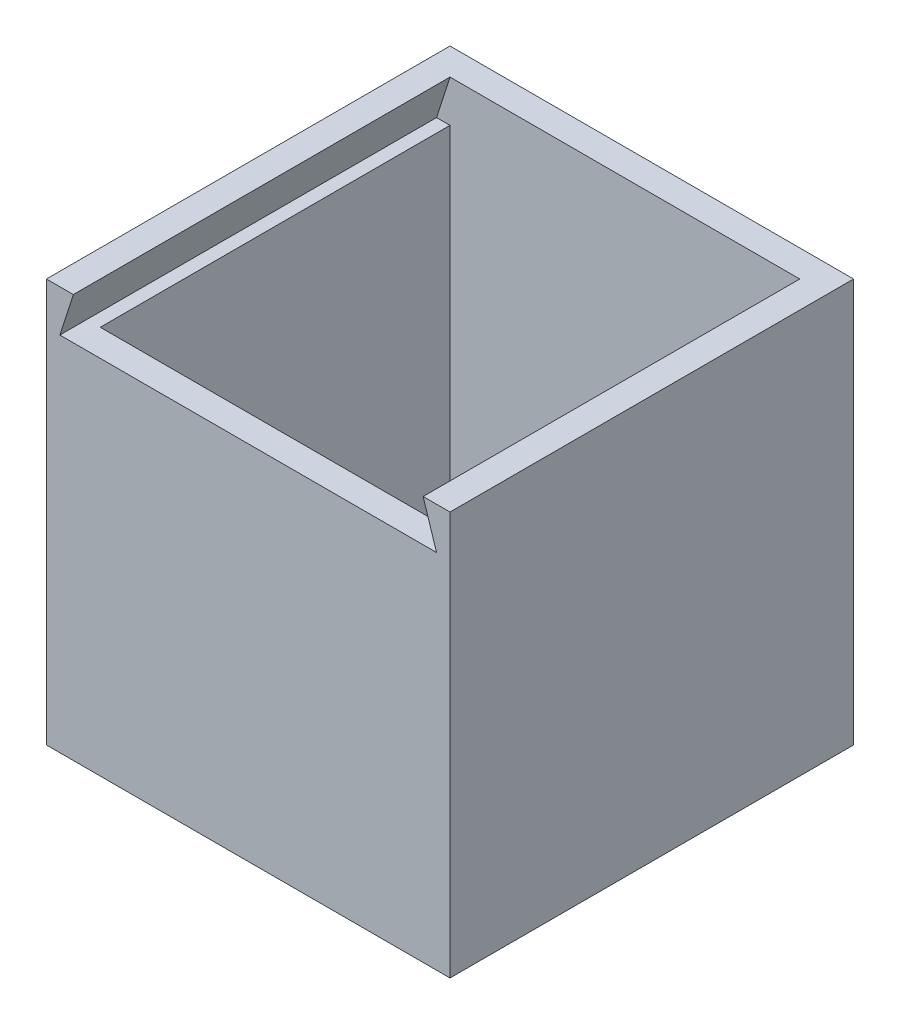
ISO-10303-21;
HEADER;
FILE_DESCRIPTION(('STEP AP214'),'2;1');
FILE_NAME('part.step','',(''),(''),'','','');
FILE_SCHEMA(('AUTOMOTIVE_DESIGN { 1 0 10303 214 1 1 1 1 }'));
ENDSEC;
DATA;
#1=APPLICATION_CONTEXT('core data for automotive mechanical design processes');
#2=APPLICATION_PROTOCOL_DEFINITION('international standard','automotive_design',2000,#1);
#3=PRODUCT_CONTEXT('',#1,'mechanical');
#4=PRODUCT('Part','Part','',(#3));
#5=PRODUCT_RELATED_PRODUCT_CATEGORY('part','',(#4));
#6=PRODUCT_DEFINITION_FORMATION('','',#4);
#7=PRODUCT_DEFINITION_CONTEXT('part definition',#1,'design');
#8=PRODUCT_DEFINITION('design','',#6,#7);
#9=PRODUCT_DEFINITION_SHAPE('','',#8);
#10=(LENGTH_UNIT() NAMED_UNIT(*) SI_UNIT(.MILLI.,.METRE.));
#11=(NAMED_UNIT(*) PLANE_ANGLE_UNIT() SI_UNIT($,.RADIAN.));
#12=(NAMED_UNIT(*) SI_UNIT($,.STERADIAN.) SOLID_ANGLE_UNIT());
#13=UNCERTAINTY_MEASURE_WITH_UNIT(LENGTH_MEASURE(1.E-05),#10,'distance_accuracy_value','');
#14=(GEOMETRIC_REPRESENTATION_CONTEXT(3) GLOBAL_UNCERTAINTY_ASSIGNED_CONTEXT((#13)) GLOBAL_UNIT_ASSIGNED_CONTEXT((#10,
#11,#12)) REPRESENTATION_CONTEXT('',''));
#15=CARTESIAN_POINT('',(0.,0.,0.));
#16=DIRECTION('',(0.,0.,1.));
#17=DIRECTION('',(1.,0.,0.));
#18=AXIS2_PLACEMENT_3D('',#15,#16,#17);
#19=CARTESIAN_POINT('',(-47.8838042101931,95.25,-26.1326923076923));
#20=DIRECTION('',(1.,0.,0.));
#21=DIRECTION('',(0.,0.,-1.));
#22=AXIS2_PLACEMENT_3D('',#19,#20,#21);
#23=PLANE('',#22);
#24=DIRECTION('',(0.,0.,1.));
#25=VECTOR('',#24,1.);
#26=CARTESIAN_POINT('',(-47.8838042101931,0.,-26.1326923076923));
#27=LINE('',#26,#25);
#28=CARTESIAN_POINT('',(-47.8838042101931,0.,-26.1326923076923));
#29=VERTEX_POINT('',#28);
#30=CARTESIAN_POINT('',(-47.8838042101931,0.,69.1173076923077));
#31=VERTEX_POINT('',#30);
#32=EDGE_CURVE('E183',#29,#31,#27,.T.);
#33=ORIENTED_EDGE('',*,*,#32,.T.);
#34=DIRECTION('',(0.,-1.,0.));
#35=VECTOR('',#34,1.);
#36=CARTESIAN_POINT('',(-47.8838042101931,95.25,69.1173076923077));
#37=LINE('',#36,#35);
#38=CARTESIAN_POINT('',(-47.8838042101931,95.25,69.1173076923077));
#39=VERTEX_POINT('',#38);
#40=EDGE_CURVE('E11',#39,#31,#37,.T.);
#41=ORIENTED_EDGE('',*,*,#40,.F.);
#42=DIRECTION('',(0.,0.,1.));
#43=VECTOR('',#42,1.);
#44=CARTESIAN_POINT('',(-47.8838042101931,95.25,-26.1326923076923));
#45=LINE('',#44,#43);
#46=CARTESIAN_POINT('',(-47.8838042101931,95.25,-26.1326923076923));
#47=VERTEX_POINT('',#46);
#48=EDGE_CURVE('E202',#47,#39,#45,.T.);
#49=ORIENTED_EDGE('',*,*,#48,.F.);
#50=DIRECTION('',(0.,-1.,0.));
#51=VECTOR('',#50,1.);
#52=CARTESIAN_POINT('',(-47.8838042101931,95.25,-26.1326923076923));
#53=LINE('',#52,#51);
#54=EDGE_CURVE('E209',#47,#29,#53,.T.);
#55=ORIENTED_EDGE('',*,*,#54,.T.);
#56=EDGE_LOOP('',(#33,#41,#49,#55));
#57=FACE_BOUND('',#56,.T.);
#58=ADVANCED_FACE('F39',(#57),#23,.F.);
#59=CARTESIAN_POINT('',(-47.8838042101931,95.25,69.1173076923077));
#60=DIRECTION('',(0.,0.,-1.));
#61=DIRECTION('',(-1.,0.,0.));
#62=AXIS2_PLACEMENT_3D('',#59,#60,#61);
#63=PLANE('',#62);
#64=DIRECTION('',(1.,0.,0.));
#65=VECTOR('',#64,1.);
#66=CARTESIAN_POINT('',(0.,85.3814987924544,69.1173076923077));
#67=LINE('',#66,#65);
#68=CARTESIAN_POINT('',(-44.7088042101931,85.3814987924544,69.1173076923077));
#69=VERTEX_POINT('',#68);
#70=CARTESIAN_POINT('',(44.1911957898069,85.3814987924544,69.1173076923077));
#71=VERTEX_POINT('',#70);
#72=EDGE_CURVE('E150',#69,#71,#67,.T.);
#73=ORIENTED_EDGE('',*,*,#72,.F.);
#74=DIRECTION('',(-0.306269863762809,-0.951944730827747,0.));
#75=VECTOR('',#74,1.);
#76=CARTESIAN_POINT('',(-65.4082086942581,21.043830084905,69.1173076923077));
#77=LINE('',#76,#75);
#78=CARTESIAN_POINT('',(-41.5338042101931,95.25,69.1173076923077));
#79=VERTEX_POINT('',#78);
#80=EDGE_CURVE('E144',#79,#69,#77,.T.);
#81=ORIENTED_EDGE('',*,*,#80,.F.);
#82=DIRECTION('',(1.,0.,0.));
#83=VECTOR('',#82,1.);
#84=CARTESIAN_POINT('',(-47.8838042101931,95.25,69.1173076923077));
#85=LINE('',#84,#83);
#86=EDGE_CURVE('E90',#39,#79,#85,.T.);
#87=ORIENTED_EDGE('',*,*,#86,.F.);
#88=ORIENTED_EDGE('',*,*,#40,.T.);
#89=DIRECTION('',(1.,0.,0.));
#90=VECTOR('',#89,1.);
#91=CARTESIAN_POINT('',(-47.8838042101931,0.,69.1173076923077));
#92=LINE('',#91,#90);
#93=CARTESIAN_POINT('',(47.3661957898069,0.,69.1173076923077));
#94=VERTEX_POINT('',#93);
#95=EDGE_CURVE('E212',#31,#94,#92,.T.);
#96=ORIENTED_EDGE('',*,*,#95,.T.);
#97=DIRECTION('',(0.,-1.,0.));
#98=VECTOR('',#97,1.);
#99=CARTESIAN_POINT('',(47.3661957898069,95.25,69.1173076923077));
#100=LINE('',#99,#98);
#101=CARTESIAN_POINT('',(47.3661957898069,95.25,69.1173076923077));
#102=VERTEX_POINT('',#101);
#103=EDGE_CURVE('E46',#102,#94,#100,.T.);
#104=ORIENTED_EDGE('',*,*,#103,.F.);
#105=CARTESIAN_POINT('',(41.0161957898069,95.25,69.1173076923077));
#106=VERTEX_POINT('',#105);
#107=EDGE_CURVE('E204',#106,#102,#85,.T.);
#108=ORIENTED_EDGE('',*,*,#107,.F.);
#109=DIRECTION('',(-0.306269863762809,0.951944730827747,0.));
#110=VECTOR('',#109,1.);
#111=CARTESIAN_POINT('',(64.9391525800774,20.8929203235134,69.1173076923077));
#112=LINE('',#111,#110);
#113=EDGE_CURVE('E166',#71,#106,#112,.T.);
#114=ORIENTED_EDGE('',*,*,#113,.F.);
#115=EDGE_LOOP('',(#73,#81,#87,#88,#96,#104,#108,#114));
#116=FACE_BOUND('',#115,.T.);
#117=ADVANCED_FACE('F243',(#116),#63,.F.);
#118=CARTESIAN_POINT('',(47.3661957898069,95.25,-26.1326923076923));
#119=DIRECTION('',(-1.,0.,0.));
#120=DIRECTION('',(0.,0.,1.));
#121=AXIS2_PLACEMENT_3D('',#118,#119,#120);
#122=PLANE('',#121);
#123=DIRECTION('',(0.,0.,-1.));
#124=VECTOR('',#123,1.);
#125=CARTESIAN_POINT('',(47.3661957898069,0.,-26.1326923076923));
#126=LINE('',#125,#124);
#127=CARTESIAN_POINT('',(47.3661957898069,0.,-26.1326923076923));
#128=VERTEX_POINT('',#127);
#129=EDGE_CURVE('E214',#94,#128,#126,.T.);
#130=ORIENTED_EDGE('',*,*,#129,.T.);
#131=DIRECTION('',(0.,-1.,0.));
#132=VECTOR('',#131,1.);
#133=CARTESIAN_POINT('',(47.3661957898069,95.25,-26.1326923076923));
#134=LINE('',#133,#132);
#135=CARTESIAN_POINT('',(47.3661957898069,95.25,-26.1326923076923));
#136=VERTEX_POINT('',#135);
#137=EDGE_CURVE('E218',#136,#128,#134,.T.);
#138=ORIENTED_EDGE('',*,*,#137,.F.);
#139=DIRECTION('',(0.,0.,-1.));
#140=VECTOR('',#139,1.);
#141=CARTESIAN_POINT('',(47.3661957898069,95.25,-26.1326923076923));
#142=LINE('',#141,#140);
#143=EDGE_CURVE('E206',#102,#136,#142,.T.);
#144=ORIENTED_EDGE('',*,*,#143,.F.);
#145=ORIENTED_EDGE('',*,*,#103,.T.);
#146=EDGE_LOOP('',(#130,#138,#144,#145));
#147=FACE_BOUND('',#146,.T.);
#148=ADVANCED_FACE('F224',(#147),#122,.F.);
#149=CARTESIAN_POINT('',(-47.8838042101931,95.25,-26.1326923076923));
#150=DIRECTION('',(0.,0.,1.));
#151=DIRECTION('',(1.,0.,0.));
#152=AXIS2_PLACEMENT_3D('',#149,#150,#151);
#153=PLANE('',#152);
#154=DIRECTION('',(-1.,0.,0.));
#155=VECTOR('',#154,1.);
#156=CARTESIAN_POINT('',(-47.8838042101931,0.,-26.1326923076923));
#157=LINE('',#156,#155);
#158=EDGE_CURVE('E83',#128,#29,#157,.T.);
#159=ORIENTED_EDGE('',*,*,#158,.T.);
#160=ORIENTED_EDGE('',*,*,#54,.F.);
#161=DIRECTION('',(-1.,0.,0.));
#162=VECTOR('',#161,1.);
#163=CARTESIAN_POINT('',(-47.8838042101931,95.25,-26.1326923076923));
#164=LINE('',#163,#162);
#165=EDGE_CURVE('E62',#136,#47,#164,.T.);
#166=ORIENTED_EDGE('',*,*,#165,.F.);
#167=ORIENTED_EDGE('',*,*,#137,.T.);
#168=EDGE_LOOP('',(#159,#160,#166,#167));
#169=FACE_BOUND('',#168,.T.);
#170=ADVANCED_FACE('F233',(#169),#153,.F.);
#171=CARTESIAN_POINT('',(0.,95.25,0.));
#172=DIRECTION('',(0.,1.,0.));
#173=DIRECTION('',(0.,0.,1.));
#174=AXIS2_PLACEMENT_3D('',#171,#172,#173);
#175=PLANE('',#174);
#176=ORIENTED_EDGE('',*,*,#86,.T.);
#177=DIRECTION('',(0.,0.,1.));
#178=VECTOR('',#177,1.);
#179=CARTESIAN_POINT('',(-41.5338042101931,95.25,-26.1326923076923));
#180=LINE('',#179,#178);
#181=CARTESIAN_POINT('',(-41.5338042101931,95.25,-19.7826923076923));
#182=VERTEX_POINT('',#181);
#183=EDGE_CURVE('E198',#182,#79,#180,.T.);
#184=ORIENTED_EDGE('',*,*,#183,.F.);
#185=DIRECTION('',(-1.,0.,0.));
#186=VECTOR('',#185,1.);
#187=CARTESIAN_POINT('',(-47.8838042101931,95.25,-19.7826923076923));
#188=LINE('',#187,#186);
#189=CARTESIAN_POINT('',(41.0161957898069,95.25,-19.7826923076923));
#190=VERTEX_POINT('',#189);
#191=EDGE_CURVE('E187',#190,#182,#188,.T.);
#192=ORIENTED_EDGE('',*,*,#191,.F.);
#193=DIRECTION('',(0.,0.,-1.));
#194=VECTOR('',#193,1.);
#195=CARTESIAN_POINT('',(41.0161957898069,95.25,-26.1326923076923));
#196=LINE('',#195,#194);
#197=EDGE_CURVE('E158',#106,#190,#196,.T.);
#198=ORIENTED_EDGE('',*,*,#197,.F.);
#199=ORIENTED_EDGE('',*,*,#107,.T.);
#200=ORIENTED_EDGE('',*,*,#143,.T.);
#201=ORIENTED_EDGE('',*,*,#165,.T.);
#202=ORIENTED_EDGE('',*,*,#48,.T.);
#203=EDGE_LOOP('',(#176,#184,#192,#198,#199,#200,#201,#202));
#204=FACE_BOUND('',#203,.T.);
#205=ADVANCED_FACE('F235',(#204),#175,.T.);
#206=CARTESIAN_POINT('',(0.,0.,0.));
#207=DIRECTION('',(0.,1.,0.));
#208=DIRECTION('',(0.,0.,1.));
#209=AXIS2_PLACEMENT_3D('',#206,#207,#208);
#210=PLANE('',#209);
#211=ORIENTED_EDGE('',*,*,#32,.F.);
#212=ORIENTED_EDGE('',*,*,#158,.F.);
#213=ORIENTED_EDGE('',*,*,#129,.F.);
#214=ORIENTED_EDGE('',*,*,#95,.F.);
#215=EDGE_LOOP('',(#211,#212,#213,#214));
#216=FACE_BOUND('',#215,.T.);
#217=ADVANCED_FACE('F229',(#216),#210,.F.);
#218=CARTESIAN_POINT('',(-41.5338042101931,95.25,-26.1326923076923));
#219=DIRECTION('',(1.,0.,0.));
#220=DIRECTION('',(0.,0.,-1.));
#221=AXIS2_PLACEMENT_3D('',#218,#219,#220);
#222=PLANE('',#221);
#223=DIRECTION('',(0.,0.,-1.));
#224=VECTOR('',#223,1.);
#225=CARTESIAN_POINT('',(-41.5338042101931,85.3814987924544,-26.1326923076923));
#226=LINE('',#225,#224);
#227=CARTESIAN_POINT('',(-41.5338042101931,85.3814987924544,62.7673076923077));
#228=VERTEX_POINT('',#227);
#229=CARTESIAN_POINT('',(-41.5338042101931,85.3814987924544,-19.7826923076923));
#230=VERTEX_POINT('',#229);
#231=EDGE_CURVE('E175',#228,#230,#226,.T.);
#232=ORIENTED_EDGE('',*,*,#231,.F.);
#233=DIRECTION('',(0.,-1.,0.));
#234=VECTOR('',#233,1.);
#235=CARTESIAN_POINT('',(-41.5338042101931,95.25,62.7673076923077));
#236=LINE('',#235,#234);
#237=CARTESIAN_POINT('',(-41.5338042101931,6.35,62.7673076923077));
#238=VERTEX_POINT('',#237);
#239=EDGE_CURVE('E181',#228,#238,#236,.T.);
#240=ORIENTED_EDGE('',*,*,#239,.T.);
#241=DIRECTION('',(0.,0.,1.));
#242=VECTOR('',#241,1.);
#243=CARTESIAN_POINT('',(-41.5338042101931,6.34999999999999,-26.1326923076923));
#244=LINE('',#243,#242);
#245=CARTESIAN_POINT('',(-41.5338042101931,6.35,-19.7826923076923));
#246=VERTEX_POINT('',#245);
#247=EDGE_CURVE('E177',#246,#238,#244,.T.);
#248=ORIENTED_EDGE('',*,*,#247,.F.);
#249=DIRECTION('',(0.,-1.,0.));
#250=VECTOR('',#249,1.);
#251=CARTESIAN_POINT('',(-41.5338042101931,95.25,-19.7826923076923));
#252=LINE('',#251,#250);
#253=EDGE_CURVE('E185',#230,#246,#252,.T.);
#254=ORIENTED_EDGE('',*,*,#253,.F.);
#255=EDGE_LOOP('',(#232,#240,#248,#254));
#256=FACE_BOUND('',#255,.T.);
#257=ADVANCED_FACE('F262',(#256),#222,.T.);
#258=CARTESIAN_POINT('',(-47.8838042101931,95.25,62.7673076923077));
#259=DIRECTION('',(0.,0.,-1.));
#260=DIRECTION('',(-1.,0.,0.));
#261=AXIS2_PLACEMENT_3D('',#258,#259,#260);
#262=PLANE('',#261);
#263=DIRECTION('',(-1.,0.,0.));
#264=VECTOR('',#263,1.);
#265=CARTESIAN_POINT('',(-47.8838042101931,85.3814987924544,62.7673076923077));
#266=LINE('',#265,#264);
#267=CARTESIAN_POINT('',(41.0161957898069,85.3814987924544,62.7673076923077));
#268=VERTEX_POINT('',#267);
#269=EDGE_CURVE('E173',#268,#228,#266,.T.);
#270=ORIENTED_EDGE('',*,*,#269,.F.);
#271=DIRECTION('',(0.,-1.,0.));
#272=VECTOR('',#271,1.);
#273=CARTESIAN_POINT('',(41.0161957898069,95.25,62.7673076923077));
#274=LINE('',#273,#272);
#275=CARTESIAN_POINT('',(41.0161957898069,6.35,62.7673076923077));
#276=VERTEX_POINT('',#275);
#277=EDGE_CURVE('E184',#268,#276,#274,.T.);
#278=ORIENTED_EDGE('',*,*,#277,.T.);
#279=DIRECTION('',(1.,0.,0.));
#280=VECTOR('',#279,1.);
#281=CARTESIAN_POINT('',(-47.8838042101931,6.34999999999999,62.7673076923077));
#282=LINE('',#281,#280);
#283=EDGE_CURVE('E180',#238,#276,#282,.T.);
#284=ORIENTED_EDGE('',*,*,#283,.F.);
#285=ORIENTED_EDGE('',*,*,#239,.F.);
#286=EDGE_LOOP('',(#270,#278,#284,#285));
#287=FACE_BOUND('',#286,.T.);
#288=ADVANCED_FACE('F266',(#287),#262,.T.);
#289=CARTESIAN_POINT('',(41.0161957898069,95.25,-26.1326923076923));
#290=DIRECTION('',(-1.,0.,0.));
#291=DIRECTION('',(0.,0.,1.));
#292=AXIS2_PLACEMENT_3D('',#289,#290,#291);
#293=PLANE('',#292);
#294=DIRECTION('',(0.,0.,1.));
#295=VECTOR('',#294,1.);
#296=CARTESIAN_POINT('',(41.0161957898069,85.3814987924544,-26.1326923076923));
#297=LINE('',#296,#295);
#298=CARTESIAN_POINT('',(41.0161957898069,85.3814987924544,-19.7826923076923));
#299=VERTEX_POINT('',#298);
#300=EDGE_CURVE('E170',#299,#268,#297,.T.);
#301=ORIENTED_EDGE('',*,*,#300,.F.);
#302=DIRECTION('',(0.,-1.,0.));
#303=VECTOR('',#302,1.);
#304=CARTESIAN_POINT('',(41.0161957898069,95.25,-19.7826923076923));
#305=LINE('',#304,#303);
#306=CARTESIAN_POINT('',(41.0161957898069,6.35,-19.7826923076923));
#307=VERTEX_POINT('',#306);
#308=EDGE_CURVE('E140',#299,#307,#305,.T.);
#309=ORIENTED_EDGE('',*,*,#308,.T.);
#310=DIRECTION('',(0.,0.,-1.));
#311=VECTOR('',#310,1.);
#312=CARTESIAN_POINT('',(41.0161957898069,6.34999999999999,-26.1326923076923));
#313=LINE('',#312,#311);
#314=EDGE_CURVE('E190',#276,#307,#313,.T.);
#315=ORIENTED_EDGE('',*,*,#314,.F.);
#316=ORIENTED_EDGE('',*,*,#277,.F.);
#317=EDGE_LOOP('',(#301,#309,#315,#316));
#318=FACE_BOUND('',#317,.T.);
#319=ADVANCED_FACE('F272',(#318),#293,.T.);
#320=CARTESIAN_POINT('',(-47.8838042101931,95.25,-19.7826923076923));
#321=DIRECTION('',(0.,0.,1.));
#322=DIRECTION('',(1.,0.,0.));
#323=AXIS2_PLACEMENT_3D('',#320,#321,#322);
#324=PLANE('',#323);
#325=ORIENTED_EDGE('',*,*,#308,.F.);
#326=DIRECTION('',(1.,0.,0.));
#327=VECTOR('',#326,1.);
#328=CARTESIAN_POINT('',(0.,85.3814987924544,-19.7826923076923));
#329=LINE('',#328,#327);
#330=CARTESIAN_POINT('',(44.1911957898069,85.3814987924544,-19.7826923076923));
#331=VERTEX_POINT('',#330);
#332=EDGE_CURVE('E136',#299,#331,#329,.T.);
#333=ORIENTED_EDGE('',*,*,#332,.T.);
#334=DIRECTION('',(-0.306269863762809,0.951944730827747,0.));
#335=VECTOR('',#334,1.);
#336=CARTESIAN_POINT('',(64.9391525800774,20.8929203235134,-19.7826923076923));
#337=LINE('',#336,#335);
#338=EDGE_CURVE('E53',#331,#190,#337,.T.);
#339=ORIENTED_EDGE('',*,*,#338,.T.);
#340=ORIENTED_EDGE('',*,*,#191,.T.);
#341=DIRECTION('',(-0.306269863762809,-0.951944730827747,0.));
#342=VECTOR('',#341,1.);
#343=CARTESIAN_POINT('',(-65.4082086942581,21.043830084905,-19.7826923076923));
#344=LINE('',#343,#342);
#345=CARTESIAN_POINT('',(-44.7088042101931,85.3814987924544,-19.7826923076923));
#346=VERTEX_POINT('',#345);
#347=EDGE_CURVE('E155',#182,#346,#344,.T.);
#348=ORIENTED_EDGE('',*,*,#347,.T.);
#349=EDGE_CURVE('E143',#346,#230,#329,.T.);
#350=ORIENTED_EDGE('',*,*,#349,.T.);
#351=ORIENTED_EDGE('',*,*,#253,.T.);
#352=DIRECTION('',(-1.,0.,0.));
#353=VECTOR('',#352,1.);
#354=CARTESIAN_POINT('',(-47.8838042101931,6.34999999999999,-19.7826923076923));
#355=LINE('',#354,#353);
#356=EDGE_CURVE('E194',#307,#246,#355,.T.);
#357=ORIENTED_EDGE('',*,*,#356,.F.);
#358=EDGE_LOOP('',(#325,#333,#339,#340,#348,#350,#351,#357));
#359=FACE_BOUND('',#358,.T.);
#360=ADVANCED_FACE('F138',(#359),#324,.T.);
#361=CARTESIAN_POINT('',(0.,6.35,0.));
#362=DIRECTION('',(0.,1.,0.));
#363=DIRECTION('',(0.,0.,1.));
#364=AXIS2_PLACEMENT_3D('',#361,#362,#363);
#365=PLANE('',#364);
#366=ORIENTED_EDGE('',*,*,#247,.T.);
#367=ORIENTED_EDGE('',*,*,#283,.T.);
#368=ORIENTED_EDGE('',*,*,#314,.T.);
#369=ORIENTED_EDGE('',*,*,#356,.T.);
#370=EDGE_LOOP('',(#366,#367,#368,#369));
#371=FACE_BOUND('',#370,.T.);
#372=ADVANCED_FACE('F270',(#371),#365,.T.);
#373=CARTESIAN_POINT('',(0.,85.3814987924544,-19.7826923076923));
#374=DIRECTION('',(0.,-1.,0.));
#375=DIRECTION('',(0.,0.,-1.));
#376=AXIS2_PLACEMENT_3D('',#373,#374,#375);
#377=PLANE('',#376);
#378=ORIENTED_EDGE('',*,*,#231,.T.);
#379=ORIENTED_EDGE('',*,*,#349,.F.);
#380=DIRECTION('',(0.,0.,1.));
#381=VECTOR('',#380,1.);
#382=CARTESIAN_POINT('',(-44.7088042101931,85.3814987924544,-19.7826923076923));
#383=LINE('',#382,#381);
#384=EDGE_CURVE('E154',#346,#69,#383,.T.);
#385=ORIENTED_EDGE('',*,*,#384,.T.);
#386=ORIENTED_EDGE('',*,*,#72,.T.);
#387=DIRECTION('',(0.,0.,1.));
#388=VECTOR('',#387,1.);
#389=CARTESIAN_POINT('',(44.1911957898069,85.3814987924544,-19.7826923076923));
#390=LINE('',#389,#388);
#391=EDGE_CURVE('E147',#331,#71,#390,.T.);
#392=ORIENTED_EDGE('',*,*,#391,.F.);
#393=ORIENTED_EDGE('',*,*,#332,.F.);
#394=ORIENTED_EDGE('',*,*,#300,.T.);
#395=ORIENTED_EDGE('',*,*,#269,.T.);
#396=EDGE_LOOP('',(#378,#379,#385,#386,#392,#393,#394,#395));
#397=FACE_BOUND('',#396,.T.);
#398=ADVANCED_FACE('F148',(#397),#377,.F.);
#399=CARTESIAN_POINT('',(-65.4082086942581,21.043830084905,-19.7826923076923));
#400=DIRECTION('',(-0.951944730827746,0.306269863762809,0.));
#401=DIRECTION('',(-0.306269863762809,-0.951944730827747,0.));
#402=AXIS2_PLACEMENT_3D('',#399,#400,#401);
#403=PLANE('',#402);
#404=ORIENTED_EDGE('',*,*,#80,.T.);
#405=ORIENTED_EDGE('',*,*,#384,.F.);
#406=ORIENTED_EDGE('',*,*,#347,.F.);
#407=ORIENTED_EDGE('',*,*,#183,.T.);
#408=EDGE_LOOP('',(#404,#405,#406,#407));
#409=FACE_BOUND('',#408,.T.);
#410=ADVANCED_FACE('F257',(#409),#403,.F.);
#411=CARTESIAN_POINT('',(64.9391525800774,20.8929203235134,-19.7826923076923));
#412=DIRECTION('',(0.951944730827746,0.306269863762809,0.));
#413=DIRECTION('',(-0.306269863762809,0.951944730827747,0.));
#414=AXIS2_PLACEMENT_3D('',#411,#412,#413);
#415=PLANE('',#414);
#416=ORIENTED_EDGE('',*,*,#113,.T.);
#417=ORIENTED_EDGE('',*,*,#197,.T.);
#418=ORIENTED_EDGE('',*,*,#338,.F.);
#419=ORIENTED_EDGE('',*,*,#391,.T.);
#420=EDGE_LOOP('',(#416,#417,#418,#419));
#421=FACE_BOUND('',#420,.T.);
#422=ADVANCED_FACE('F157',(#421),#415,.F.);
#423=CLOSED_SHELL('',(#58,#117,#148,#170,#205,#217,#257,#288,#319,#360,#372,#398,#410,#422));
#424=MANIFOLD_SOLID_BREP('B2',#423);
#425=ADVANCED_BREP_SHAPE_REPRESENTATION('',(#18,#424),#14);
#426=SHAPE_DEFINITION_REPRESENTATION(#9,#425);
ENDSEC;
END-ISO-10303-21;
